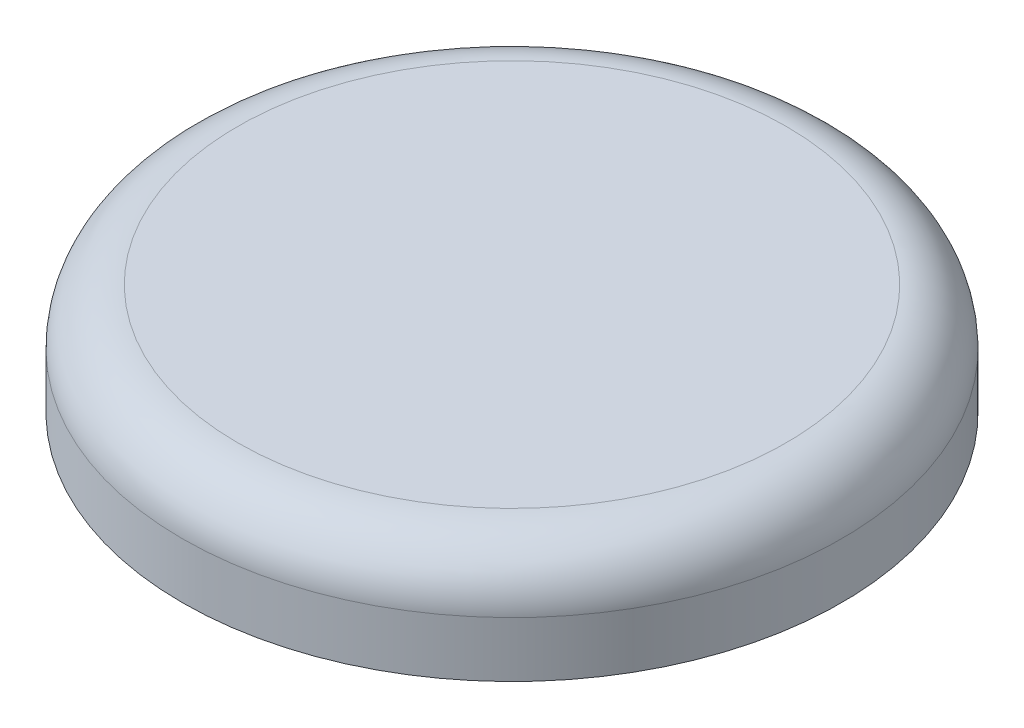
ISO-10303-21;
HEADER;
FILE_DESCRIPTION(('STEP AP214'),'2;1');
FILE_NAME('part.step','',(''),(''),'','','');
FILE_SCHEMA(('AUTOMOTIVE_DESIGN { 1 0 10303 214 1 1 1 1 }'));
ENDSEC;
DATA;
#1=APPLICATION_CONTEXT('core data for automotive mechanical design processes');
#2=APPLICATION_PROTOCOL_DEFINITION('international standard','automotive_design',2000,#1);
#3=PRODUCT_CONTEXT('',#1,'mechanical');
#4=PRODUCT('Part','Part','',(#3));
#5=PRODUCT_RELATED_PRODUCT_CATEGORY('part','',(#4));
#6=PRODUCT_DEFINITION_FORMATION('','',#4);
#7=PRODUCT_DEFINITION_CONTEXT('part definition',#1,'design');
#8=PRODUCT_DEFINITION('design','',#6,#7);
#9=PRODUCT_DEFINITION_SHAPE('','',#8);
#10=(LENGTH_UNIT() NAMED_UNIT(*) SI_UNIT(.MILLI.,.METRE.));
#11=(NAMED_UNIT(*) PLANE_ANGLE_UNIT() SI_UNIT($,.RADIAN.));
#12=(NAMED_UNIT(*) SI_UNIT($,.STERADIAN.) SOLID_ANGLE_UNIT());
#13=UNCERTAINTY_MEASURE_WITH_UNIT(LENGTH_MEASURE(1.E-05),#10,'distance_accuracy_value','');
#14=(GEOMETRIC_REPRESENTATION_CONTEXT(3) GLOBAL_UNCERTAINTY_ASSIGNED_CONTEXT((#13)) GLOBAL_UNIT_ASSIGNED_CONTEXT((#10,
#11,#12)) REPRESENTATION_CONTEXT('',''));
#15=CARTESIAN_POINT('',(0.,0.,0.));
#16=DIRECTION('',(0.,0.,1.));
#17=DIRECTION('',(1.,0.,0.));
#18=AXIS2_PLACEMENT_3D('',#15,#16,#17);
#19=CARTESIAN_POINT('',(0.,2.,0.));
#20=DIRECTION('',(0.,-1.,0.));
#21=DIRECTION('',(0.,0.,-1.));
#22=AXIS2_PLACEMENT_3D('',#19,#20,#21);
#23=CYLINDRICAL_SURFACE('',#22,5.95);
#24=CARTESIAN_POINT('',(0.,1.,0.));
#25=DIRECTION('',(0.,1.,0.));
#26=DIRECTION('',(0.,0.,1.));
#27=AXIS2_PLACEMENT_3D('',#24,#25,#26);
#28=CIRCLE('',#27,5.95);
#29=CARTESIAN_POINT('',(0.,1.,5.95));
#30=VERTEX_POINT('',#29);
#31=EDGE_CURVE('E10',#30,#30,#28,.F.);
#32=ORIENTED_EDGE('',*,*,#31,.T.);
#33=EDGE_LOOP('',(#32));
#34=FACE_BOUND('',#33,.T.);
#35=CARTESIAN_POINT('',(0.,0.,0.));
#36=DIRECTION('',(0.,1.,0.));
#37=DIRECTION('',(0.,0.,1.));
#38=AXIS2_PLACEMENT_3D('',#35,#36,#37);
#39=CIRCLE('',#38,5.95);
#40=CARTESIAN_POINT('',(0.,0.,5.95));
#41=VERTEX_POINT('',#40);
#42=EDGE_CURVE('E43',#41,#41,#39,.T.);
#43=ORIENTED_EDGE('',*,*,#42,.T.);
#44=EDGE_LOOP('',(#43));
#45=FACE_BOUND('',#44,.T.);
#46=ADVANCED_FACE('F32',(#34,#45),#23,.T.);
#47=CARTESIAN_POINT('',(0.,2.,0.));
#48=DIRECTION('',(0.,1.,0.));
#49=DIRECTION('',(0.,0.,1.));
#50=AXIS2_PLACEMENT_3D('',#47,#48,#49);
#51=PLANE('',#50);
#52=CARTESIAN_POINT('',(0.,2.,0.));
#53=DIRECTION('',(0.,1.,0.));
#54=DIRECTION('',(0.,0.,1.));
#55=AXIS2_PLACEMENT_3D('',#52,#53,#54);
#56=CIRCLE('',#55,4.95);
#57=CARTESIAN_POINT('',(0.,2.,4.95));
#58=VERTEX_POINT('',#57);
#59=EDGE_CURVE('E39',#58,#58,#56,.T.);
#60=ORIENTED_EDGE('',*,*,#59,.T.);
#61=EDGE_LOOP('',(#60));
#62=FACE_BOUND('',#61,.T.);
#63=ADVANCED_FACE('F53',(#62),#51,.T.);
#64=CARTESIAN_POINT('',(0.,0.,0.));
#65=DIRECTION('',(0.,1.,0.));
#66=DIRECTION('',(0.,0.,1.));
#67=AXIS2_PLACEMENT_3D('',#64,#65,#66);
#68=PLANE('',#67);
#69=ORIENTED_EDGE('',*,*,#42,.F.);
#70=EDGE_LOOP('',(#69));
#71=FACE_BOUND('',#70,.T.);
#72=ADVANCED_FACE('F51',(#71),#68,.F.);
#73=CARTESIAN_POINT('',(0.,1.,0.));
#74=DIRECTION('',(0.,1.,0.));
#75=DIRECTION('',(0.,0.,1.));
#76=AXIS2_PLACEMENT_3D('',#73,#74,#75);
#77=TOROIDAL_SURFACE('',#76,4.95,1.);
#78=ORIENTED_EDGE('',*,*,#31,.F.);
#79=EDGE_LOOP('',(#78));
#80=FACE_BOUND('',#79,.T.);
#81=ORIENTED_EDGE('',*,*,#59,.F.);
#82=EDGE_LOOP('',(#81));
#83=FACE_BOUND('',#82,.T.);
#84=ADVANCED_FACE('F34',(#80,#83),#77,.T.);
#85=CLOSED_SHELL('',(#46,#63,#72,#84));
#86=MANIFOLD_SOLID_BREP('B2',#85);
#87=ADVANCED_BREP_SHAPE_REPRESENTATION('',(#18,#86),#14);
#88=SHAPE_DEFINITION_REPRESENTATION(#9,#87);
ENDSEC;
END-ISO-10303-21;
